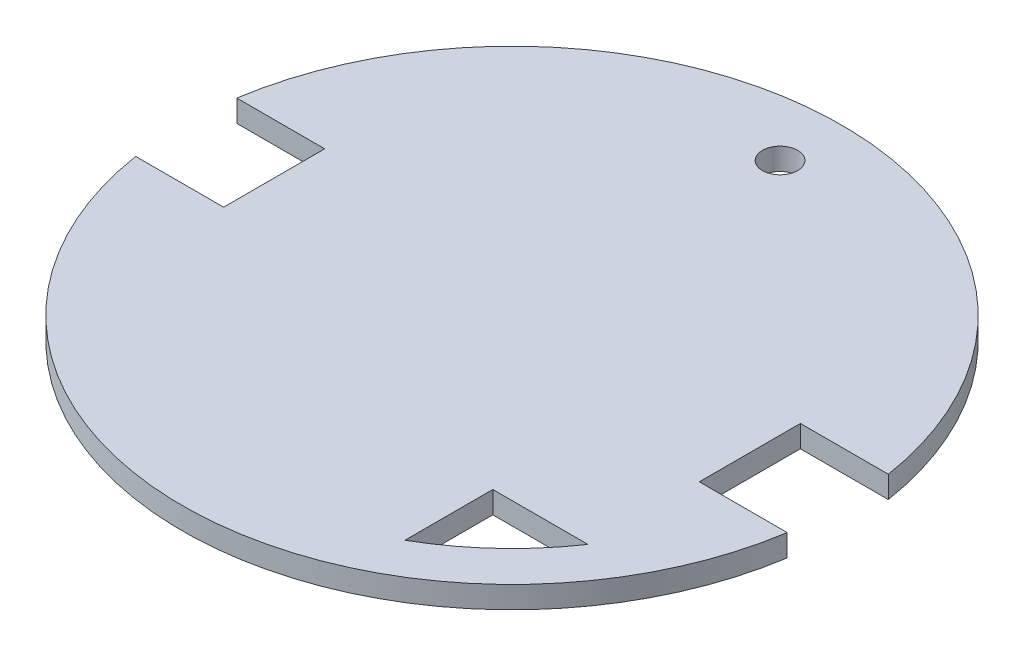
ISO-10303-21;
HEADER;
FILE_DESCRIPTION(('STEP AP214'),'2;1');
FILE_NAME('part.step','',(''),(''),'','','');
FILE_SCHEMA(('AUTOMOTIVE_DESIGN { 1 0 10303 214 1 1 1 1 }'));
ENDSEC;
DATA;
#1=APPLICATION_CONTEXT('core data for automotive mechanical design processes');
#2=APPLICATION_PROTOCOL_DEFINITION('international standard','automotive_design',2000,#1);
#3=PRODUCT_CONTEXT('',#1,'mechanical');
#4=PRODUCT('Part','Part','',(#3));
#5=PRODUCT_RELATED_PRODUCT_CATEGORY('part','',(#4));
#6=PRODUCT_DEFINITION_FORMATION('','',#4);
#7=PRODUCT_DEFINITION_CONTEXT('part definition',#1,'design');
#8=PRODUCT_DEFINITION('design','',#6,#7);
#9=PRODUCT_DEFINITION_SHAPE('','',#8);
#10=(LENGTH_UNIT() NAMED_UNIT(*) SI_UNIT(.MILLI.,.METRE.));
#11=(NAMED_UNIT(*) PLANE_ANGLE_UNIT() SI_UNIT($,.RADIAN.));
#12=(NAMED_UNIT(*) SI_UNIT($,.STERADIAN.) SOLID_ANGLE_UNIT());
#13=UNCERTAINTY_MEASURE_WITH_UNIT(LENGTH_MEASURE(1.E-05),#10,'distance_accuracy_value','');
#14=(GEOMETRIC_REPRESENTATION_CONTEXT(3) GLOBAL_UNCERTAINTY_ASSIGNED_CONTEXT((#13)) GLOBAL_UNIT_ASSIGNED_CONTEXT((#10,
#11,#12)) REPRESENTATION_CONTEXT('',''));
#15=CARTESIAN_POINT('',(0.,0.,0.));
#16=DIRECTION('',(0.,0.,1.));
#17=DIRECTION('',(1.,0.,0.));
#18=AXIS2_PLACEMENT_3D('',#15,#16,#17);
#19=CARTESIAN_POINT('',(-5.93581678931924,5.,0.));
#20=DIRECTION('',(0.,-1.,0.));
#21=DIRECTION('',(0.,0.,-1.));
#22=AXIS2_PLACEMENT_3D('',#19,#20,#21);
#23=CYLINDRICAL_SURFACE('',#22,75.);
#24=DIRECTION('',(0.,-1.,0.));
#25=VECTOR('',#24,1.);
#26=CARTESIAN_POINT('',(-80.0489060516081,5.,11.5));
#27=LINE('',#26,#25);
#28=CARTESIAN_POINT('',(-80.0489060516081,0.,11.5));
#29=VERTEX_POINT('',#28);
#30=CARTESIAN_POINT('',(-80.0489060516081,5.,11.5));
#31=VERTEX_POINT('',#30);
#32=EDGE_CURVE('E222',#29,#31,#27,.F.);
#33=ORIENTED_EDGE('',*,*,#32,.F.);
#34=CARTESIAN_POINT('',(-5.93581678931924,0.,0.));
#35=DIRECTION('',(0.,1.,0.));
#36=DIRECTION('',(0.,0.,1.));
#37=AXIS2_PLACEMENT_3D('',#34,#35,#36);
#38=CIRCLE('',#37,75.);
#39=CARTESIAN_POINT('',(68.1772724729696,0.,11.5));
#40=VERTEX_POINT('',#39);
#41=EDGE_CURVE('E229',#29,#40,#38,.T.);
#42=ORIENTED_EDGE('',*,*,#41,.T.);
#43=DIRECTION('',(0.,-1.,0.));
#44=VECTOR('',#43,1.);
#45=CARTESIAN_POINT('',(68.1772724729696,5.,11.5));
#46=LINE('',#45,#44);
#47=CARTESIAN_POINT('',(68.1772724729696,5.,11.5));
#48=VERTEX_POINT('',#47);
#49=EDGE_CURVE('E219',#48,#40,#46,.T.);
#50=ORIENTED_EDGE('',*,*,#49,.F.);
#51=CARTESIAN_POINT('',(-5.93581678931924,5.,0.));
#52=DIRECTION('',(0.,1.,0.));
#53=DIRECTION('',(0.,0.,1.));
#54=AXIS2_PLACEMENT_3D('',#51,#52,#53);
#55=CIRCLE('',#54,75.);
#56=EDGE_CURVE('E230',#31,#48,#55,.T.);
#57=ORIENTED_EDGE('',*,*,#56,.F.);
#58=EDGE_LOOP('',(#33,#42,#50,#57));
#59=FACE_BOUND('',#58,.T.);
#60=ADVANCED_FACE('F39',(#59),#23,.T.);
#61=CARTESIAN_POINT('',(68.1772724729696,0.,-11.5));
#62=VERTEX_POINT('',#61);
#63=CARTESIAN_POINT('',(-80.0489060516081,0.,-11.5));
#64=VERTEX_POINT('',#63);
#65=EDGE_CURVE('E235',#62,#64,#38,.T.);
#66=ORIENTED_EDGE('',*,*,#65,.T.);
#67=DIRECTION('',(0.,-1.,0.));
#68=VECTOR('',#67,1.);
#69=CARTESIAN_POINT('',(-80.0489060516081,5.,-11.5));
#70=LINE('',#69,#68);
#71=CARTESIAN_POINT('',(-80.0489060516081,5.,-11.5));
#72=VERTEX_POINT('',#71);
#73=EDGE_CURVE('E225',#64,#72,#70,.F.);
#74=ORIENTED_EDGE('',*,*,#73,.T.);
#75=CARTESIAN_POINT('',(68.1772724729696,5.,-11.5));
#76=VERTEX_POINT('',#75);
#77=EDGE_CURVE('E234',#76,#72,#55,.T.);
#78=ORIENTED_EDGE('',*,*,#77,.F.);
#79=DIRECTION('',(0.,-1.,0.));
#80=VECTOR('',#79,1.);
#81=CARTESIAN_POINT('',(68.1772724729696,5.,-11.5));
#82=LINE('',#81,#80);
#83=EDGE_CURVE('E156',#76,#62,#82,.T.);
#84=ORIENTED_EDGE('',*,*,#83,.T.);
#85=EDGE_LOOP('',(#66,#74,#78,#84));
#86=FACE_BOUND('',#85,.T.);
#87=ADVANCED_FACE('F252',(#86),#23,.T.);
#88=CARTESIAN_POINT('',(-5.93581678931924,5.,0.));
#89=DIRECTION('',(0.,1.,0.));
#90=DIRECTION('',(0.,0.,1.));
#91=AXIS2_PLACEMENT_3D('',#88,#89,#90);
#92=PLANE('',#91);
#93=DIRECTION('',(0.,0.,1.));
#94=VECTOR('',#93,1.);
#95=CARTESIAN_POINT('',(26.2006111391238,5.,0.));
#96=LINE('',#95,#94);
#97=CARTESIAN_POINT('',(26.2006111391238,5.,36.4999999999999));
#98=VERTEX_POINT('',#97);
#99=CARTESIAN_POINT('',(26.2006111391238,5.,56.4999999999999));
#100=VERTEX_POINT('',#99);
#101=EDGE_CURVE('E54',#98,#100,#96,.T.);
#102=ORIENTED_EDGE('',*,*,#101,.F.);
#103=DIRECTION('',(-1.,0.,0.));
#104=VECTOR('',#103,1.);
#105=CARTESIAN_POINT('',(0.,5.,36.4999999999999));
#106=LINE('',#105,#104);
#107=CARTESIAN_POINT('',(47.8484745976648,5.,36.4999999999999));
#108=VERTEX_POINT('',#107);
#109=EDGE_CURVE('E139',#108,#98,#106,.T.);
#110=ORIENTED_EDGE('',*,*,#109,.F.);
#111=CARTESIAN_POINT('',(-5.93581678931925,5.,0.));
#112=DIRECTION('',(0.,1.,0.));
#113=DIRECTION('',(0.,0.,1.));
#114=AXIS2_PLACEMENT_3D('',#111,#112,#113);
#115=CIRCLE('',#114,65.);
#116=EDGE_CURVE('E143',#100,#108,#115,.T.);
#117=ORIENTED_EDGE('',*,*,#116,.F.);
#118=EDGE_LOOP('',(#102,#110,#117));
#119=FACE_BOUND('',#118,.T.);
#120=CARTESIAN_POINT('',(-5.94890605160822,5.,-60.9999985956657));
#121=DIRECTION('',(0.,1.,0.));
#122=DIRECTION('',(0.,0.,1.));
#123=AXIS2_PLACEMENT_3D('',#120,#121,#122);
#124=CIRCLE('',#123,4.);
#125=CARTESIAN_POINT('',(-5.94890605160822,5.,-56.9999985956657));
#126=VERTEX_POINT('',#125);
#127=EDGE_CURVE('E162',#126,#126,#124,.T.);
#128=ORIENTED_EDGE('',*,*,#127,.F.);
#129=EDGE_LOOP('',(#128));
#130=FACE_BOUND('',#129,.T.);
#131=DIRECTION('',(-1.,0.,0.));
#132=VECTOR('',#131,1.);
#133=CARTESIAN_POINT('',(0.,5.,-11.5));
#134=LINE('',#133,#132);
#135=CARTESIAN_POINT('',(-60.0489060516081,5.,-11.5));
#136=VERTEX_POINT('',#135);
#137=EDGE_CURVE('E180',#136,#72,#134,.T.);
#138=ORIENTED_EDGE('',*,*,#137,.F.);
#139=DIRECTION('',(0.,0.,1.));
#140=VECTOR('',#139,1.);
#141=CARTESIAN_POINT('',(-60.0489060516081,5.,-1.44929735004453E-13));
#142=LINE('',#141,#140);
#143=CARTESIAN_POINT('',(-60.0489060516082,5.,11.5));
#144=VERTEX_POINT('',#143);
#145=EDGE_CURVE('E172',#136,#144,#142,.T.);
#146=ORIENTED_EDGE('',*,*,#145,.T.);
#147=DIRECTION('',(-1.,0.,0.));
#148=VECTOR('',#147,1.);
#149=CARTESIAN_POINT('',(0.,5.,11.5));
#150=LINE('',#149,#148);
#151=EDGE_CURVE('E183',#144,#31,#150,.T.);
#152=ORIENTED_EDGE('',*,*,#151,.T.);
#153=ORIENTED_EDGE('',*,*,#56,.T.);
#154=DIRECTION('',(-1.,0.,0.));
#155=VECTOR('',#154,1.);
#156=CARTESIAN_POINT('',(0.,5.,11.5));
#157=LINE('',#156,#155);
#158=CARTESIAN_POINT('',(48.1772724729696,5.,11.5));
#159=VERTEX_POINT('',#158);
#160=EDGE_CURVE('E201',#48,#159,#157,.T.);
#161=ORIENTED_EDGE('',*,*,#160,.T.);
#162=DIRECTION('',(0.,0.,1.));
#163=VECTOR('',#162,1.);
#164=CARTESIAN_POINT('',(48.1772724729696,5.,0.));
#165=LINE('',#164,#163);
#166=CARTESIAN_POINT('',(48.1772724729696,5.,-11.5));
#167=VERTEX_POINT('',#166);
#168=EDGE_CURVE('E200',#167,#159,#165,.T.);
#169=ORIENTED_EDGE('',*,*,#168,.F.);
#170=DIRECTION('',(-1.,0.,0.));
#171=VECTOR('',#170,1.);
#172=CARTESIAN_POINT('',(0.,5.,-11.5));
#173=LINE('',#172,#171);
#174=EDGE_CURVE('E205',#76,#167,#173,.T.);
#175=ORIENTED_EDGE('',*,*,#174,.F.);
#176=ORIENTED_EDGE('',*,*,#77,.T.);
#177=EDGE_LOOP('',(#138,#146,#152,#153,#161,#169,#175,#176));
#178=FACE_BOUND('',#177,.T.);
#179=ADVANCED_FACE('F248',(#119,#130,#178),#92,.T.);
#180=CARTESIAN_POINT('',(-5.93581678931924,0.,0.));
#181=DIRECTION('',(0.,1.,0.));
#182=DIRECTION('',(0.,0.,1.));
#183=AXIS2_PLACEMENT_3D('',#180,#181,#182);
#184=PLANE('',#183);
#185=DIRECTION('',(-1.,0.,0.));
#186=VECTOR('',#185,1.);
#187=CARTESIAN_POINT('',(0.,0.,36.4999999999999));
#188=LINE('',#187,#186);
#189=CARTESIAN_POINT('',(47.8484745976648,0.,36.4999999999999));
#190=VERTEX_POINT('',#189);
#191=CARTESIAN_POINT('',(26.2006111391238,0.,36.4999999999999));
#192=VERTEX_POINT('',#191);
#193=EDGE_CURVE('E62',#190,#192,#188,.T.);
#194=ORIENTED_EDGE('',*,*,#193,.T.);
#195=DIRECTION('',(0.,0.,1.));
#196=VECTOR('',#195,1.);
#197=CARTESIAN_POINT('',(26.2006111391238,0.,0.));
#198=LINE('',#197,#196);
#199=CARTESIAN_POINT('',(26.2006111391238,0.,56.4999999999999));
#200=VERTEX_POINT('',#199);
#201=EDGE_CURVE('E123',#192,#200,#198,.T.);
#202=ORIENTED_EDGE('',*,*,#201,.T.);
#203=CARTESIAN_POINT('',(-5.93581678931925,0.,0.));
#204=DIRECTION('',(0.,1.,0.));
#205=DIRECTION('',(0.,0.,1.));
#206=AXIS2_PLACEMENT_3D('',#203,#204,#205);
#207=CIRCLE('',#206,65.);
#208=EDGE_CURVE('E131',#200,#190,#207,.T.);
#209=ORIENTED_EDGE('',*,*,#208,.T.);
#210=EDGE_LOOP('',(#194,#202,#209));
#211=FACE_BOUND('',#210,.T.);
#212=CARTESIAN_POINT('',(-5.94890605160822,0.,-60.9999985956657));
#213=DIRECTION('',(0.,1.,0.));
#214=DIRECTION('',(0.,0.,1.));
#215=AXIS2_PLACEMENT_3D('',#212,#213,#214);
#216=CIRCLE('',#215,4.);
#217=CARTESIAN_POINT('',(-5.94890605160822,0.,-56.9999985956657));
#218=VERTEX_POINT('',#217);
#219=EDGE_CURVE('E150',#218,#218,#216,.T.);
#220=ORIENTED_EDGE('',*,*,#219,.T.);
#221=EDGE_LOOP('',(#220));
#222=FACE_BOUND('',#221,.T.);
#223=DIRECTION('',(0.,0.,1.));
#224=VECTOR('',#223,1.);
#225=CARTESIAN_POINT('',(-60.0489060516081,0.,-1.44929735004453E-13));
#226=LINE('',#225,#224);
#227=CARTESIAN_POINT('',(-60.0489060516081,0.,-11.5));
#228=VERTEX_POINT('',#227);
#229=CARTESIAN_POINT('',(-60.0489060516082,0.,11.5));
#230=VERTEX_POINT('',#229);
#231=EDGE_CURVE('E175',#228,#230,#226,.T.);
#232=ORIENTED_EDGE('',*,*,#231,.F.);
#233=DIRECTION('',(-1.,0.,0.));
#234=VECTOR('',#233,1.);
#235=CARTESIAN_POINT('',(0.,0.,-11.5));
#236=LINE('',#235,#234);
#237=EDGE_CURVE('E167',#228,#64,#236,.T.);
#238=ORIENTED_EDGE('',*,*,#237,.T.);
#239=ORIENTED_EDGE('',*,*,#65,.F.);
#240=DIRECTION('',(-1.,0.,0.));
#241=VECTOR('',#240,1.);
#242=CARTESIAN_POINT('',(-5.93581678931924,0.,-11.5));
#243=LINE('',#242,#241);
#244=CARTESIAN_POINT('',(48.1772724729696,0.,-11.5));
#245=VERTEX_POINT('',#244);
#246=EDGE_CURVE('E47',#62,#245,#243,.T.);
#247=ORIENTED_EDGE('',*,*,#246,.T.);
#248=DIRECTION('',(0.,0.,1.));
#249=VECTOR('',#248,1.);
#250=CARTESIAN_POINT('',(48.1772724729696,0.,0.));
#251=LINE('',#250,#249);
#252=CARTESIAN_POINT('',(48.1772724729696,0.,11.5));
#253=VERTEX_POINT('',#252);
#254=EDGE_CURVE('E195',#245,#253,#251,.T.);
#255=ORIENTED_EDGE('',*,*,#254,.T.);
#256=DIRECTION('',(-1.,0.,0.));
#257=VECTOR('',#256,1.);
#258=CARTESIAN_POINT('',(-5.93581678931924,0.,11.5));
#259=LINE('',#258,#257);
#260=EDGE_CURVE('E11',#40,#253,#259,.T.);
#261=ORIENTED_EDGE('',*,*,#260,.F.);
#262=ORIENTED_EDGE('',*,*,#41,.F.);
#263=DIRECTION('',(-1.,0.,0.));
#264=VECTOR('',#263,1.);
#265=CARTESIAN_POINT('',(0.,0.,11.5));
#266=LINE('',#265,#264);
#267=EDGE_CURVE('E171',#230,#29,#266,.T.);
#268=ORIENTED_EDGE('',*,*,#267,.F.);
#269=EDGE_LOOP('',(#232,#238,#239,#247,#255,#261,#262,#268));
#270=FACE_BOUND('',#269,.T.);
#271=ADVANCED_FACE('F136',(#211,#222,#270),#184,.F.);
#272=CARTESIAN_POINT('',(0.,0.,11.5));
#273=DIRECTION('',(0.,0.,-1.));
#274=DIRECTION('',(-1.,0.,0.));
#275=AXIS2_PLACEMENT_3D('',#272,#273,#274);
#276=PLANE('',#275);
#277=ORIENTED_EDGE('',*,*,#49,.T.);
#278=ORIENTED_EDGE('',*,*,#260,.T.);
#279=DIRECTION('',(0.,1.,0.));
#280=VECTOR('',#279,1.);
#281=CARTESIAN_POINT('',(48.1772724729696,0.,11.5));
#282=LINE('',#281,#280);
#283=EDGE_CURVE('E184',#253,#159,#282,.T.);
#284=ORIENTED_EDGE('',*,*,#283,.T.);
#285=ORIENTED_EDGE('',*,*,#160,.F.);
#286=EDGE_LOOP('',(#277,#278,#284,#285));
#287=FACE_BOUND('',#286,.T.);
#288=ADVANCED_FACE('F270',(#287),#276,.T.);
#289=CARTESIAN_POINT('',(0.,0.,-11.5));
#290=DIRECTION('',(0.,0.,-1.));
#291=DIRECTION('',(-1.,0.,0.));
#292=AXIS2_PLACEMENT_3D('',#289,#290,#291);
#293=PLANE('',#292);
#294=ORIENTED_EDGE('',*,*,#174,.T.);
#295=DIRECTION('',(0.,1.,0.));
#296=VECTOR('',#295,1.);
#297=CARTESIAN_POINT('',(48.1772724729696,0.,-11.5));
#298=LINE('',#297,#296);
#299=EDGE_CURVE('E199',#245,#167,#298,.T.);
#300=ORIENTED_EDGE('',*,*,#299,.F.);
#301=ORIENTED_EDGE('',*,*,#246,.F.);
#302=ORIENTED_EDGE('',*,*,#83,.F.);
#303=EDGE_LOOP('',(#294,#300,#301,#302));
#304=FACE_BOUND('',#303,.T.);
#305=ADVANCED_FACE('F276',(#304),#293,.F.);
#306=CARTESIAN_POINT('',(48.1772724729696,0.,0.));
#307=DIRECTION('',(-1.,0.,0.));
#308=DIRECTION('',(0.,0.,1.));
#309=AXIS2_PLACEMENT_3D('',#306,#307,#308);
#310=PLANE('',#309);
#311=ORIENTED_EDGE('',*,*,#168,.T.);
#312=ORIENTED_EDGE('',*,*,#283,.F.);
#313=ORIENTED_EDGE('',*,*,#254,.F.);
#314=ORIENTED_EDGE('',*,*,#299,.T.);
#315=EDGE_LOOP('',(#311,#312,#313,#314));
#316=FACE_BOUND('',#315,.T.);
#317=ADVANCED_FACE('F274',(#316),#310,.F.);
#318=CARTESIAN_POINT('',(0.,0.,-11.5));
#319=DIRECTION('',(0.,0.,-1.));
#320=DIRECTION('',(-1.,0.,0.));
#321=AXIS2_PLACEMENT_3D('',#318,#319,#320);
#322=PLANE('',#321);
#323=ORIENTED_EDGE('',*,*,#237,.F.);
#324=DIRECTION('',(0.,1.,0.));
#325=VECTOR('',#324,1.);
#326=CARTESIAN_POINT('',(-60.0489060516081,0.,-11.5));
#327=LINE('',#326,#325);
#328=EDGE_CURVE('E166',#228,#136,#327,.T.);
#329=ORIENTED_EDGE('',*,*,#328,.T.);
#330=ORIENTED_EDGE('',*,*,#137,.T.);
#331=ORIENTED_EDGE('',*,*,#73,.F.);
#332=EDGE_LOOP('',(#323,#329,#330,#331));
#333=FACE_BOUND('',#332,.T.);
#334=ADVANCED_FACE('F255',(#333),#322,.F.);
#335=CARTESIAN_POINT('',(0.,0.,11.5));
#336=DIRECTION('',(0.,0.,-1.));
#337=DIRECTION('',(-1.,0.,0.));
#338=AXIS2_PLACEMENT_3D('',#335,#336,#337);
#339=PLANE('',#338);
#340=ORIENTED_EDGE('',*,*,#32,.T.);
#341=ORIENTED_EDGE('',*,*,#151,.F.);
#342=DIRECTION('',(0.,1.,0.));
#343=VECTOR('',#342,1.);
#344=CARTESIAN_POINT('',(-60.0489060516082,0.,11.5));
#345=LINE('',#344,#343);
#346=EDGE_CURVE('E179',#230,#144,#345,.T.);
#347=ORIENTED_EDGE('',*,*,#346,.F.);
#348=ORIENTED_EDGE('',*,*,#267,.T.);
#349=EDGE_LOOP('',(#340,#341,#347,#348));
#350=FACE_BOUND('',#349,.T.);
#351=ADVANCED_FACE('F311',(#350),#339,.T.);
#352=CARTESIAN_POINT('',(-60.0489060516081,0.,-1.44929735004453E-13));
#353=DIRECTION('',(-1.,0.,0.));
#354=DIRECTION('',(0.,0.,1.));
#355=AXIS2_PLACEMENT_3D('',#352,#353,#354);
#356=PLANE('',#355);
#357=ORIENTED_EDGE('',*,*,#145,.F.);
#358=ORIENTED_EDGE('',*,*,#328,.F.);
#359=ORIENTED_EDGE('',*,*,#231,.T.);
#360=ORIENTED_EDGE('',*,*,#346,.T.);
#361=EDGE_LOOP('',(#357,#358,#359,#360));
#362=FACE_BOUND('',#361,.T.);
#363=ADVANCED_FACE('F261',(#362),#356,.T.);
#364=CARTESIAN_POINT('',(-5.94890605160822,0.,-60.9999985956657));
#365=DIRECTION('',(0.,1.,0.));
#366=DIRECTION('',(0.,0.,1.));
#367=AXIS2_PLACEMENT_3D('',#364,#365,#366);
#368=CYLINDRICAL_SURFACE('',#367,4.);
#369=ORIENTED_EDGE('',*,*,#219,.F.);
#370=EDGE_LOOP('',(#369));
#371=FACE_BOUND('',#370,.T.);
#372=ORIENTED_EDGE('',*,*,#127,.T.);
#373=EDGE_LOOP('',(#372));
#374=FACE_BOUND('',#373,.T.);
#375=ADVANCED_FACE('F301',(#371,#374),#368,.F.);
#376=CARTESIAN_POINT('',(26.2006111391238,0.,0.));
#377=DIRECTION('',(-1.,0.,0.));
#378=DIRECTION('',(0.,0.,1.));
#379=AXIS2_PLACEMENT_3D('',#376,#377,#378);
#380=PLANE('',#379);
#381=ORIENTED_EDGE('',*,*,#101,.T.);
#382=DIRECTION('',(0.,1.,0.));
#383=VECTOR('',#382,1.);
#384=CARTESIAN_POINT('',(26.2006111391238,0.,56.4999999999999));
#385=LINE('',#384,#383);
#386=EDGE_CURVE('E119',#200,#100,#385,.T.);
#387=ORIENTED_EDGE('',*,*,#386,.F.);
#388=ORIENTED_EDGE('',*,*,#201,.F.);
#389=DIRECTION('',(0.,1.,0.));
#390=VECTOR('',#389,1.);
#391=CARTESIAN_POINT('',(26.2006111391238,0.,36.4999999999999));
#392=LINE('',#391,#390);
#393=EDGE_CURVE('E153',#192,#98,#392,.T.);
#394=ORIENTED_EDGE('',*,*,#393,.T.);
#395=EDGE_LOOP('',(#381,#387,#388,#394));
#396=FACE_BOUND('',#395,.T.);
#397=ADVANCED_FACE('F121',(#396),#380,.F.);
#398=CARTESIAN_POINT('',(0.,0.,36.4999999999999));
#399=DIRECTION('',(0.,0.,-1.));
#400=DIRECTION('',(-1.,0.,0.));
#401=AXIS2_PLACEMENT_3D('',#398,#399,#400);
#402=PLANE('',#401);
#403=ORIENTED_EDGE('',*,*,#109,.T.);
#404=ORIENTED_EDGE('',*,*,#393,.F.);
#405=ORIENTED_EDGE('',*,*,#193,.F.);
#406=DIRECTION('',(0.,1.,0.));
#407=VECTOR('',#406,1.);
#408=CARTESIAN_POINT('',(47.8484745976648,0.,36.4999999999999));
#409=LINE('',#408,#407);
#410=EDGE_CURVE('E128',#190,#108,#409,.T.);
#411=ORIENTED_EDGE('',*,*,#410,.T.);
#412=EDGE_LOOP('',(#403,#404,#405,#411));
#413=FACE_BOUND('',#412,.T.);
#414=ADVANCED_FACE('F309',(#413),#402,.F.);
#415=CARTESIAN_POINT('',(-5.93581678931925,0.,0.));
#416=DIRECTION('',(0.,1.,0.));
#417=DIRECTION('',(0.,0.,1.));
#418=AXIS2_PLACEMENT_3D('',#415,#416,#417);
#419=CYLINDRICAL_SURFACE('',#418,65.);
#420=ORIENTED_EDGE('',*,*,#116,.T.);
#421=ORIENTED_EDGE('',*,*,#410,.F.);
#422=ORIENTED_EDGE('',*,*,#208,.F.);
#423=ORIENTED_EDGE('',*,*,#386,.T.);
#424=EDGE_LOOP('',(#420,#421,#422,#423));
#425=FACE_BOUND('',#424,.T.);
#426=ADVANCED_FACE('F132',(#425),#419,.F.);
#427=CLOSED_SHELL('',(#60,#87,#179,#271,#288,#305,#317,#334,#351,#363,#375,#397,#414,#426));
#428=MANIFOLD_SOLID_BREP('B2',#427);
#429=ADVANCED_BREP_SHAPE_REPRESENTATION('',(#18,#428),#14);
#430=SHAPE_DEFINITION_REPRESENTATION(#9,#429);
ENDSEC;
END-ISO-10303-21;
